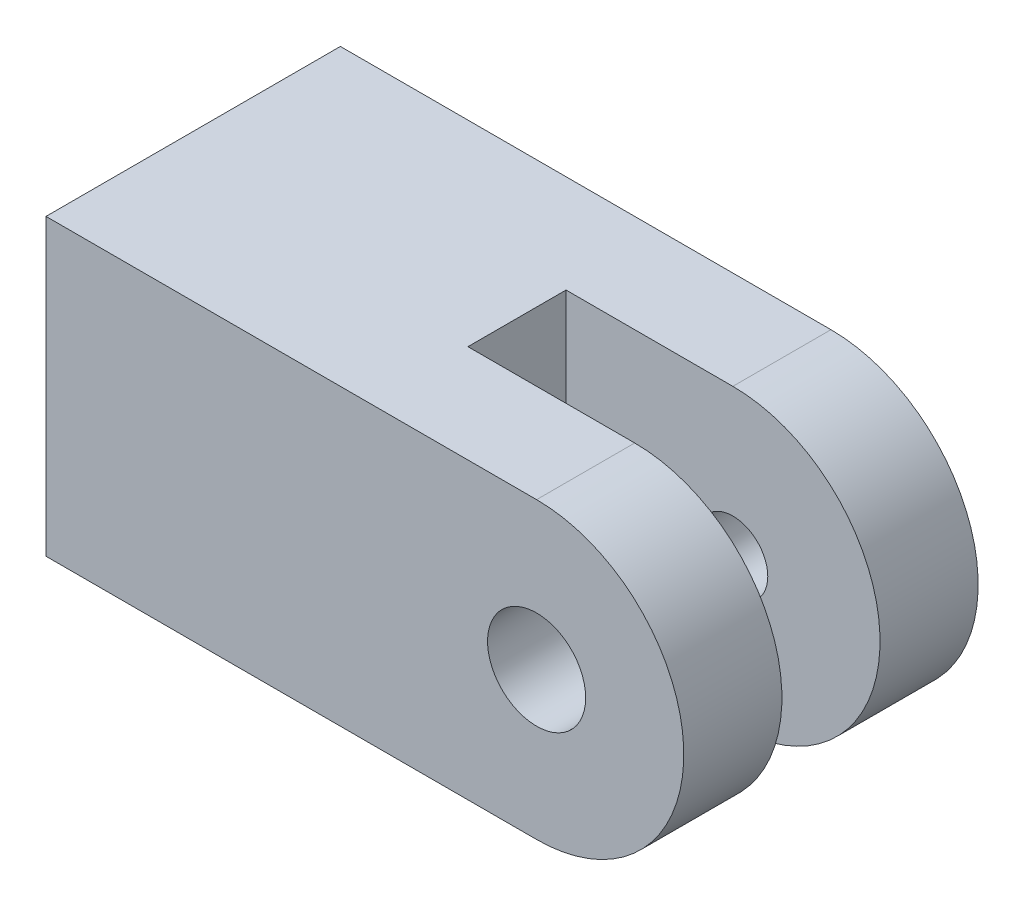
ISO-10303-21;
HEADER;
FILE_DESCRIPTION(('STEP AP214'),'2;1');
FILE_NAME('part.step','',(''),(''),'','','');
FILE_SCHEMA(('AUTOMOTIVE_DESIGN { 1 0 10303 214 1 1 1 1 }'));
ENDSEC;
DATA;
#1=APPLICATION_CONTEXT('core data for automotive mechanical design processes');
#2=APPLICATION_PROTOCOL_DEFINITION('international standard','automotive_design',2000,#1);
#3=PRODUCT_CONTEXT('',#1,'mechanical');
#4=PRODUCT('Part','Part','',(#3));
#5=PRODUCT_RELATED_PRODUCT_CATEGORY('part','',(#4));
#6=PRODUCT_DEFINITION_FORMATION('','',#4);
#7=PRODUCT_DEFINITION_CONTEXT('part definition',#1,'design');
#8=PRODUCT_DEFINITION('design','',#6,#7);
#9=PRODUCT_DEFINITION_SHAPE('','',#8);
#10=(LENGTH_UNIT() NAMED_UNIT(*) SI_UNIT(.MILLI.,.METRE.));
#11=(NAMED_UNIT(*) PLANE_ANGLE_UNIT() SI_UNIT($,.RADIAN.));
#12=(NAMED_UNIT(*) SI_UNIT($,.STERADIAN.) SOLID_ANGLE_UNIT());
#13=UNCERTAINTY_MEASURE_WITH_UNIT(LENGTH_MEASURE(1.E-05),#10,'distance_accuracy_value','');
#14=(GEOMETRIC_REPRESENTATION_CONTEXT(3) GLOBAL_UNCERTAINTY_ASSIGNED_CONTEXT((#13)) GLOBAL_UNIT_ASSIGNED_CONTEXT((#10,
#11,#12)) REPRESENTATION_CONTEXT('',''));
#15=CARTESIAN_POINT('',(0.,0.,0.));
#16=DIRECTION('',(0.,0.,1.));
#17=DIRECTION('',(1.,0.,0.));
#18=AXIS2_PLACEMENT_3D('',#15,#16,#17);
#19=CARTESIAN_POINT('',(0.,0.,4.7625));
#20=DIRECTION('',(0.,0.,-1.));
#21=DIRECTION('',(-1.,0.,0.));
#22=AXIS2_PLACEMENT_3D('',#19,#20,#21);
#23=PLANE('',#22);
#24=DIRECTION('',(-1.,0.,0.));
#25=VECTOR('',#24,1.);
#26=CARTESIAN_POINT('',(-9.525,4.7625,4.7625));
#27=LINE('',#26,#25);
#28=CARTESIAN_POINT('',(0.,4.7625,4.7625));
#29=VERTEX_POINT('',#28);
#30=CARTESIAN_POINT('',(-15.875,4.7625,4.7625));
#31=VERTEX_POINT('',#30);
#32=EDGE_CURVE('E114',#29,#31,#27,.T.);
#33=ORIENTED_EDGE('',*,*,#32,.T.);
#34=DIRECTION('',(0.,1.,0.));
#35=VECTOR('',#34,1.);
#36=CARTESIAN_POINT('',(-15.875,-4.7625,4.7625));
#37=LINE('',#36,#35);
#38=CARTESIAN_POINT('',(-15.875,-4.7625,4.7625));
#39=VERTEX_POINT('',#38);
#40=EDGE_CURVE('E179',#39,#31,#37,.T.);
#41=ORIENTED_EDGE('',*,*,#40,.F.);
#42=DIRECTION('',(1.,0.,0.));
#43=VECTOR('',#42,1.);
#44=CARTESIAN_POINT('',(-9.525,-4.7625,4.7625));
#45=LINE('',#44,#43);
#46=CARTESIAN_POINT('',(0.,-4.7625,4.7625));
#47=VERTEX_POINT('',#46);
#48=EDGE_CURVE('E131',#39,#47,#45,.T.);
#49=ORIENTED_EDGE('',*,*,#48,.T.);
#50=CARTESIAN_POINT('',(0.,0.,4.7625));
#51=DIRECTION('',(0.,0.,1.));
#52=DIRECTION('',(-1.,0.,0.));
#53=AXIS2_PLACEMENT_3D('',#50,#51,#52);
#54=CIRCLE('',#53,4.7625);
#55=EDGE_CURVE('E85',#47,#29,#54,.T.);
#56=ORIENTED_EDGE('',*,*,#55,.T.);
#57=EDGE_LOOP('',(#33,#41,#49,#56));
#58=FACE_BOUND('',#57,.T.);
#59=CARTESIAN_POINT('',(0.,0.,4.7625));
#60=DIRECTION('',(0.,0.,1.));
#61=DIRECTION('',(1.,0.,0.));
#62=AXIS2_PLACEMENT_3D('',#59,#60,#61);
#63=CIRCLE('',#62,1.5875);
#64=CARTESIAN_POINT('',(1.5875,0.,4.7625));
#65=VERTEX_POINT('',#64);
#66=EDGE_CURVE('E158',#65,#65,#63,.T.);
#67=ORIENTED_EDGE('',*,*,#66,.F.);
#68=EDGE_LOOP('',(#67));
#69=FACE_BOUND('',#68,.T.);
#70=ADVANCED_FACE('F53',(#58,#69),#23,.F.);
#71=CARTESIAN_POINT('',(0.,0.,4.7625));
#72=DIRECTION('',(0.,0.,-1.));
#73=DIRECTION('',(-1.,0.,0.));
#74=AXIS2_PLACEMENT_3D('',#71,#72,#73);
#75=CYLINDRICAL_SURFACE('',#74,4.7625);
#76=DIRECTION('',(0.,0.,-1.));
#77=VECTOR('',#76,1.);
#78=CARTESIAN_POINT('',(0.,4.7625,4.7625));
#79=LINE('',#78,#77);
#80=CARTESIAN_POINT('',(0.,4.7625,-1.5875));
#81=VERTEX_POINT('',#80);
#82=CARTESIAN_POINT('',(0.,4.7625,-4.7625));
#83=VERTEX_POINT('',#82);
#84=EDGE_CURVE('E101',#81,#83,#79,.T.);
#85=ORIENTED_EDGE('',*,*,#84,.F.);
#86=CARTESIAN_POINT('',(0.,0.,-1.5875));
#87=DIRECTION('',(0.,0.,-1.));
#88=DIRECTION('',(-1.,0.,0.));
#89=AXIS2_PLACEMENT_3D('',#86,#87,#88);
#90=CIRCLE('',#89,4.7625);
#91=CARTESIAN_POINT('',(0.,-4.7625,-1.5875));
#92=VERTEX_POINT('',#91);
#93=EDGE_CURVE('E201',#81,#92,#90,.T.);
#94=ORIENTED_EDGE('',*,*,#93,.T.);
#95=DIRECTION('',(0.,0.,-1.));
#96=VECTOR('',#95,1.);
#97=CARTESIAN_POINT('',(0.,-4.7625,4.7625));
#98=LINE('',#97,#96);
#99=CARTESIAN_POINT('',(0.,-4.7625,-4.7625));
#100=VERTEX_POINT('',#99);
#101=EDGE_CURVE('E63',#92,#100,#98,.T.);
#102=ORIENTED_EDGE('',*,*,#101,.T.);
#103=CARTESIAN_POINT('',(0.,0.,-4.7625));
#104=DIRECTION('',(0.,0.,1.));
#105=DIRECTION('',(-1.,0.,0.));
#106=AXIS2_PLACEMENT_3D('',#103,#104,#105);
#107=CIRCLE('',#106,4.7625);
#108=EDGE_CURVE('E117',#100,#83,#107,.T.);
#109=ORIENTED_EDGE('',*,*,#108,.T.);
#110=EDGE_LOOP('',(#85,#94,#102,#109));
#111=FACE_BOUND('',#110,.T.);
#112=ADVANCED_FACE('F118',(#111),#75,.T.);
#113=CARTESIAN_POINT('',(-9.525,-4.7625,4.7625));
#114=DIRECTION('',(0.,1.,0.));
#115=DIRECTION('',(-1.,0.,0.));
#116=AXIS2_PLACEMENT_3D('',#113,#114,#115);
#117=PLANE('',#116);
#118=ORIENTED_EDGE('',*,*,#101,.F.);
#119=DIRECTION('',(1.,0.,0.));
#120=VECTOR('',#119,1.);
#121=CARTESIAN_POINT('',(-5.3975,-4.7625,-1.5875));
#122=LINE('',#121,#120);
#123=CARTESIAN_POINT('',(-5.3975,-4.7625,-1.5875));
#124=VERTEX_POINT('',#123);
#125=EDGE_CURVE('E147',#124,#92,#122,.T.);
#126=ORIENTED_EDGE('',*,*,#125,.F.);
#127=DIRECTION('',(0.,0.,-1.));
#128=VECTOR('',#127,1.);
#129=CARTESIAN_POINT('',(-5.3975,-4.7625,1.5875));
#130=LINE('',#129,#128);
#131=CARTESIAN_POINT('',(-5.3975,-4.7625,1.5875));
#132=VERTEX_POINT('',#131);
#133=EDGE_CURVE('E169',#132,#124,#130,.T.);
#134=ORIENTED_EDGE('',*,*,#133,.F.);
#135=DIRECTION('',(1.,0.,0.));
#136=VECTOR('',#135,1.);
#137=CARTESIAN_POINT('',(-5.3975,-4.7625,1.5875));
#138=LINE('',#137,#136);
#139=CARTESIAN_POINT('',(0.,-4.7625,1.5875));
#140=VERTEX_POINT('',#139);
#141=EDGE_CURVE('E150',#132,#140,#138,.T.);
#142=ORIENTED_EDGE('',*,*,#141,.T.);
#143=EDGE_CURVE('E11',#47,#140,#98,.T.);
#144=ORIENTED_EDGE('',*,*,#143,.F.);
#145=ORIENTED_EDGE('',*,*,#48,.F.);
#146=DIRECTION('',(0.,0.,1.));
#147=VECTOR('',#146,1.);
#148=CARTESIAN_POINT('',(-15.875,-4.7625,-4.7625));
#149=LINE('',#148,#147);
#150=CARTESIAN_POINT('',(-15.875,-4.7625,-4.7625));
#151=VERTEX_POINT('',#150);
#152=EDGE_CURVE('E212',#151,#39,#149,.T.);
#153=ORIENTED_EDGE('',*,*,#152,.F.);
#154=DIRECTION('',(1.,0.,0.));
#155=VECTOR('',#154,1.);
#156=CARTESIAN_POINT('',(-9.525,-4.7625,-4.7625));
#157=LINE('',#156,#155);
#158=EDGE_CURVE('E124',#151,#100,#157,.T.);
#159=ORIENTED_EDGE('',*,*,#158,.T.);
#160=EDGE_LOOP('',(#118,#126,#134,#142,#144,#145,#153,#159));
#161=FACE_BOUND('',#160,.T.);
#162=ADVANCED_FACE('F55',(#161),#117,.F.);
#163=CARTESIAN_POINT('',(0.,0.,1.5875));
#164=DIRECTION('',(0.,0.,1.));
#165=DIRECTION('',(1.,0.,0.));
#166=AXIS2_PLACEMENT_3D('',#163,#164,#165);
#167=CIRCLE('',#166,4.7625);
#168=CARTESIAN_POINT('',(0.,4.7625,1.5875));
#169=VERTEX_POINT('',#168);
#170=EDGE_CURVE('E197',#140,#169,#167,.T.);
#171=ORIENTED_EDGE('',*,*,#170,.T.);
#172=EDGE_CURVE('E113',#29,#169,#79,.T.);
#173=ORIENTED_EDGE('',*,*,#172,.F.);
#174=ORIENTED_EDGE('',*,*,#55,.F.);
#175=ORIENTED_EDGE('',*,*,#143,.T.);
#176=EDGE_LOOP('',(#171,#173,#174,#175));
#177=FACE_BOUND('',#176,.T.);
#178=ADVANCED_FACE('F249',(#177),#75,.T.);
#179=CARTESIAN_POINT('',(-9.525,4.7625,4.7625));
#180=DIRECTION('',(0.,-1.,0.));
#181=DIRECTION('',(1.,0.,0.));
#182=AXIS2_PLACEMENT_3D('',#179,#180,#181);
#183=PLANE('',#182);
#184=DIRECTION('',(0.,0.,1.));
#185=VECTOR('',#184,1.);
#186=CARTESIAN_POINT('',(-5.3975,4.7625,1.5875));
#187=LINE('',#186,#185);
#188=CARTESIAN_POINT('',(-5.3975,4.7625,-1.5875));
#189=VERTEX_POINT('',#188);
#190=CARTESIAN_POINT('',(-5.3975,4.7625,1.5875));
#191=VERTEX_POINT('',#190);
#192=EDGE_CURVE('E178',#189,#191,#187,.T.);
#193=ORIENTED_EDGE('',*,*,#192,.F.);
#194=DIRECTION('',(1.,0.,0.));
#195=VECTOR('',#194,1.);
#196=CARTESIAN_POINT('',(-5.3975,4.7625,-1.5875));
#197=LINE('',#196,#195);
#198=EDGE_CURVE('E110',#189,#81,#197,.T.);
#199=ORIENTED_EDGE('',*,*,#198,.T.);
#200=ORIENTED_EDGE('',*,*,#84,.T.);
#201=DIRECTION('',(-1.,0.,0.));
#202=VECTOR('',#201,1.);
#203=CARTESIAN_POINT('',(-9.525,4.7625,-4.7625));
#204=LINE('',#203,#202);
#205=CARTESIAN_POINT('',(-15.875,4.7625,-4.7625));
#206=VERTEX_POINT('',#205);
#207=EDGE_CURVE('E108',#83,#206,#204,.T.);
#208=ORIENTED_EDGE('',*,*,#207,.T.);
#209=DIRECTION('',(0.,0.,-1.));
#210=VECTOR('',#209,1.);
#211=CARTESIAN_POINT('',(-15.875,4.7625,4.7625));
#212=LINE('',#211,#210);
#213=EDGE_CURVE('E175',#31,#206,#212,.T.);
#214=ORIENTED_EDGE('',*,*,#213,.F.);
#215=ORIENTED_EDGE('',*,*,#32,.F.);
#216=ORIENTED_EDGE('',*,*,#172,.T.);
#217=DIRECTION('',(1.,0.,0.));
#218=VECTOR('',#217,1.);
#219=CARTESIAN_POINT('',(-5.3975,4.7625,1.5875));
#220=LINE('',#219,#218);
#221=EDGE_CURVE('E153',#191,#169,#220,.T.);
#222=ORIENTED_EDGE('',*,*,#221,.F.);
#223=EDGE_LOOP('',(#193,#199,#200,#208,#214,#215,#216,#222));
#224=FACE_BOUND('',#223,.T.);
#225=ADVANCED_FACE('F104',(#224),#183,.F.);
#226=CARTESIAN_POINT('',(0.,0.,-4.7625));
#227=DIRECTION('',(0.,0.,-1.));
#228=DIRECTION('',(-1.,0.,0.));
#229=AXIS2_PLACEMENT_3D('',#226,#227,#228);
#230=PLANE('',#229);
#231=CARTESIAN_POINT('',(0.,0.,-4.7625));
#232=DIRECTION('',(0.,0.,1.));
#233=DIRECTION('',(1.,0.,0.));
#234=AXIS2_PLACEMENT_3D('',#231,#232,#233);
#235=CIRCLE('',#234,1.1303);
#236=CARTESIAN_POINT('',(1.1303,0.,-4.7625));
#237=VERTEX_POINT('',#236);
#238=EDGE_CURVE('E155',#237,#237,#235,.T.);
#239=ORIENTED_EDGE('',*,*,#238,.T.);
#240=EDGE_LOOP('',(#239));
#241=FACE_BOUND('',#240,.T.);
#242=ORIENTED_EDGE('',*,*,#158,.F.);
#243=DIRECTION('',(0.,-1.,0.));
#244=VECTOR('',#243,1.);
#245=CARTESIAN_POINT('',(-15.875,4.7625,-4.7625));
#246=LINE('',#245,#244);
#247=EDGE_CURVE('E128',#206,#151,#246,.T.);
#248=ORIENTED_EDGE('',*,*,#247,.F.);
#249=ORIENTED_EDGE('',*,*,#207,.F.);
#250=ORIENTED_EDGE('',*,*,#108,.F.);
#251=EDGE_LOOP('',(#242,#248,#249,#250));
#252=FACE_BOUND('',#251,.T.);
#253=ADVANCED_FACE('F126',(#241,#252),#230,.T.);
#254=CARTESIAN_POINT('',(-5.3975,4.7625,-1.5875));
#255=DIRECTION('',(0.,0.,-1.));
#256=DIRECTION('',(-1.,0.,0.));
#257=AXIS2_PLACEMENT_3D('',#254,#255,#256);
#258=PLANE('',#257);
#259=CARTESIAN_POINT('',(0.,0.,-1.5875));
#260=DIRECTION('',(0.,0.,1.));
#261=DIRECTION('',(1.,0.,0.));
#262=AXIS2_PLACEMENT_3D('',#259,#260,#261);
#263=CIRCLE('',#262,1.1303);
#264=CARTESIAN_POINT('',(1.1303,0.,-1.5875));
#265=VERTEX_POINT('',#264);
#266=EDGE_CURVE('E159',#265,#265,#263,.T.);
#267=ORIENTED_EDGE('',*,*,#266,.F.);
#268=EDGE_LOOP('',(#267));
#269=FACE_BOUND('',#268,.T.);
#270=ORIENTED_EDGE('',*,*,#198,.F.);
#271=DIRECTION('',(0.,1.,0.));
#272=VECTOR('',#271,1.);
#273=CARTESIAN_POINT('',(-5.3975,4.7625,-1.5875));
#274=LINE('',#273,#272);
#275=EDGE_CURVE('E73',#124,#189,#274,.T.);
#276=ORIENTED_EDGE('',*,*,#275,.F.);
#277=ORIENTED_EDGE('',*,*,#125,.T.);
#278=ORIENTED_EDGE('',*,*,#93,.F.);
#279=EDGE_LOOP('',(#270,#276,#277,#278));
#280=FACE_BOUND('',#279,.T.);
#281=ADVANCED_FACE('F230',(#269,#280),#258,.F.);
#282=CARTESIAN_POINT('',(-5.3975,4.7625,1.5875));
#283=DIRECTION('',(0.,0.,1.));
#284=DIRECTION('',(1.,0.,0.));
#285=AXIS2_PLACEMENT_3D('',#282,#283,#284);
#286=PLANE('',#285);
#287=CARTESIAN_POINT('',(0.,0.,1.5875));
#288=DIRECTION('',(0.,0.,1.));
#289=DIRECTION('',(1.,0.,0.));
#290=AXIS2_PLACEMENT_3D('',#287,#288,#289);
#291=CIRCLE('',#290,1.5875);
#292=CARTESIAN_POINT('',(1.5875,0.,1.5875));
#293=VERTEX_POINT('',#292);
#294=EDGE_CURVE('E164',#293,#293,#291,.T.);
#295=ORIENTED_EDGE('',*,*,#294,.T.);
#296=EDGE_LOOP('',(#295));
#297=FACE_BOUND('',#296,.T.);
#298=ORIENTED_EDGE('',*,*,#170,.F.);
#299=ORIENTED_EDGE('',*,*,#141,.F.);
#300=DIRECTION('',(0.,-1.,0.));
#301=VECTOR('',#300,1.);
#302=CARTESIAN_POINT('',(-5.3975,4.7625,1.5875));
#303=LINE('',#302,#301);
#304=EDGE_CURVE('E171',#191,#132,#303,.T.);
#305=ORIENTED_EDGE('',*,*,#304,.F.);
#306=ORIENTED_EDGE('',*,*,#221,.T.);
#307=EDGE_LOOP('',(#298,#299,#305,#306));
#308=FACE_BOUND('',#307,.T.);
#309=ADVANCED_FACE('F246',(#297,#308),#286,.F.);
#310=CARTESIAN_POINT('',(-5.3975,0.,0.));
#311=DIRECTION('',(1.,0.,0.));
#312=DIRECTION('',(0.,0.,-1.));
#313=AXIS2_PLACEMENT_3D('',#310,#311,#312);
#314=PLANE('',#313);
#315=CARTESIAN_POINT('',(-5.3975,0.,0.));
#316=DIRECTION('',(1.,0.,0.));
#317=DIRECTION('',(0.,0.,-1.));
#318=AXIS2_PLACEMENT_3D('',#315,#316,#317);
#319=CIRCLE('',#318,0.141973793061133);
#320=CARTESIAN_POINT('',(-5.3975,0.,-0.141973793061133));
#321=VERTEX_POINT('',#320);
#322=EDGE_CURVE('E57',#321,#321,#319,.T.);
#323=ORIENTED_EDGE('',*,*,#322,.F.);
#324=EDGE_LOOP('',(#323));
#325=FACE_BOUND('',#324,.T.);
#326=ORIENTED_EDGE('',*,*,#275,.T.);
#327=ORIENTED_EDGE('',*,*,#192,.T.);
#328=ORIENTED_EDGE('',*,*,#304,.T.);
#329=ORIENTED_EDGE('',*,*,#133,.T.);
#330=EDGE_LOOP('',(#326,#327,#328,#329));
#331=FACE_BOUND('',#330,.T.);
#332=ADVANCED_FACE('F255',(#325,#331),#314,.T.);
#333=CARTESIAN_POINT('',(-15.875,0.,0.));
#334=DIRECTION('',(-1.,0.,0.));
#335=DIRECTION('',(0.,-1.,0.));
#336=AXIS2_PLACEMENT_3D('',#333,#334,#335);
#337=PLANE('',#336);
#338=CARTESIAN_POINT('',(-15.875,0.,0.));
#339=DIRECTION('',(-1.,0.,0.));
#340=DIRECTION('',(0.,0.,1.));
#341=AXIS2_PLACEMENT_3D('',#338,#339,#340);
#342=CIRCLE('',#341,1.7272);
#343=CARTESIAN_POINT('',(-15.875,0.,1.7272));
#344=VERTEX_POINT('',#343);
#345=EDGE_CURVE('E167',#344,#344,#342,.T.);
#346=ORIENTED_EDGE('',*,*,#345,.F.);
#347=EDGE_LOOP('',(#346));
#348=FACE_BOUND('',#347,.T.);
#349=ORIENTED_EDGE('',*,*,#213,.T.);
#350=ORIENTED_EDGE('',*,*,#247,.T.);
#351=ORIENTED_EDGE('',*,*,#152,.T.);
#352=ORIENTED_EDGE('',*,*,#40,.T.);
#353=EDGE_LOOP('',(#349,#350,#351,#352));
#354=FACE_BOUND('',#353,.T.);
#355=ADVANCED_FACE('F217',(#348,#354),#337,.T.);
#356=CARTESIAN_POINT('',(-6.35,0.,0.));
#357=DIRECTION('',(-1.,0.,0.));
#358=DIRECTION('',(0.,0.,1.));
#359=AXIS2_PLACEMENT_3D('',#356,#357,#358);
#360=CONICAL_SURFACE('',#359,1.7272,1.02974425867665);
#361=ORIENTED_EDGE('',*,*,#322,.T.);
#362=EDGE_LOOP('',(#361));
#363=FACE_BOUND('',#362,.T.);
#364=CARTESIAN_POINT('',(-6.35,0.,0.));
#365=DIRECTION('',(-1.,0.,0.));
#366=DIRECTION('',(0.,0.,1.));
#367=AXIS2_PLACEMENT_3D('',#364,#365,#366);
#368=CIRCLE('',#367,1.7272);
#369=CARTESIAN_POINT('',(-6.35,0.,1.7272));
#370=VERTEX_POINT('',#369);
#371=EDGE_CURVE('E176',#370,#370,#368,.T.);
#372=ORIENTED_EDGE('',*,*,#371,.T.);
#373=EDGE_LOOP('',(#372));
#374=FACE_BOUND('',#373,.T.);
#375=ADVANCED_FACE('F262',(#363,#374),#360,.F.);
#376=CARTESIAN_POINT('',(-15.875,0.,0.));
#377=DIRECTION('',(-1.,0.,0.));
#378=DIRECTION('',(0.,0.,1.));
#379=AXIS2_PLACEMENT_3D('',#376,#377,#378);
#380=CYLINDRICAL_SURFACE('',#379,1.7272);
#381=ORIENTED_EDGE('',*,*,#371,.F.);
#382=EDGE_LOOP('',(#381));
#383=FACE_BOUND('',#382,.T.);
#384=ORIENTED_EDGE('',*,*,#345,.T.);
#385=EDGE_LOOP('',(#384));
#386=FACE_BOUND('',#385,.T.);
#387=ADVANCED_FACE('F299',(#383,#386),#380,.F.);
#388=CARTESIAN_POINT('',(0.,0.,4.7625));
#389=DIRECTION('',(0.,0.,1.));
#390=DIRECTION('',(1.,0.,0.));
#391=AXIS2_PLACEMENT_3D('',#388,#389,#390);
#392=CYLINDRICAL_SURFACE('',#391,1.5875);
#393=ORIENTED_EDGE('',*,*,#294,.F.);
#394=EDGE_LOOP('',(#393));
#395=FACE_BOUND('',#394,.T.);
#396=ORIENTED_EDGE('',*,*,#66,.T.);
#397=EDGE_LOOP('',(#396));
#398=FACE_BOUND('',#397,.T.);
#399=ADVANCED_FACE('F309',(#395,#398),#392,.F.);
#400=CARTESIAN_POINT('',(0.,0.,-1.5875));
#401=DIRECTION('',(0.,0.,1.));
#402=DIRECTION('',(1.,0.,0.));
#403=AXIS2_PLACEMENT_3D('',#400,#401,#402);
#404=CYLINDRICAL_SURFACE('',#403,1.1303);
#405=ORIENTED_EDGE('',*,*,#238,.F.);
#406=EDGE_LOOP('',(#405));
#407=FACE_BOUND('',#406,.T.);
#408=ORIENTED_EDGE('',*,*,#266,.T.);
#409=EDGE_LOOP('',(#408));
#410=FACE_BOUND('',#409,.T.);
#411=ADVANCED_FACE('F333',(#407,#410),#404,.F.);
#412=CLOSED_SHELL('',(#70,#112,#162,#178,#225,#253,#281,#309,#332,#355,#375,#387,#399,#411));
#413=MANIFOLD_SOLID_BREP('B2',#412);
#414=ADVANCED_BREP_SHAPE_REPRESENTATION('',(#18,#413),#14);
#415=SHAPE_DEFINITION_REPRESENTATION(#9,#414);
ENDSEC;
END-ISO-10303-21;
